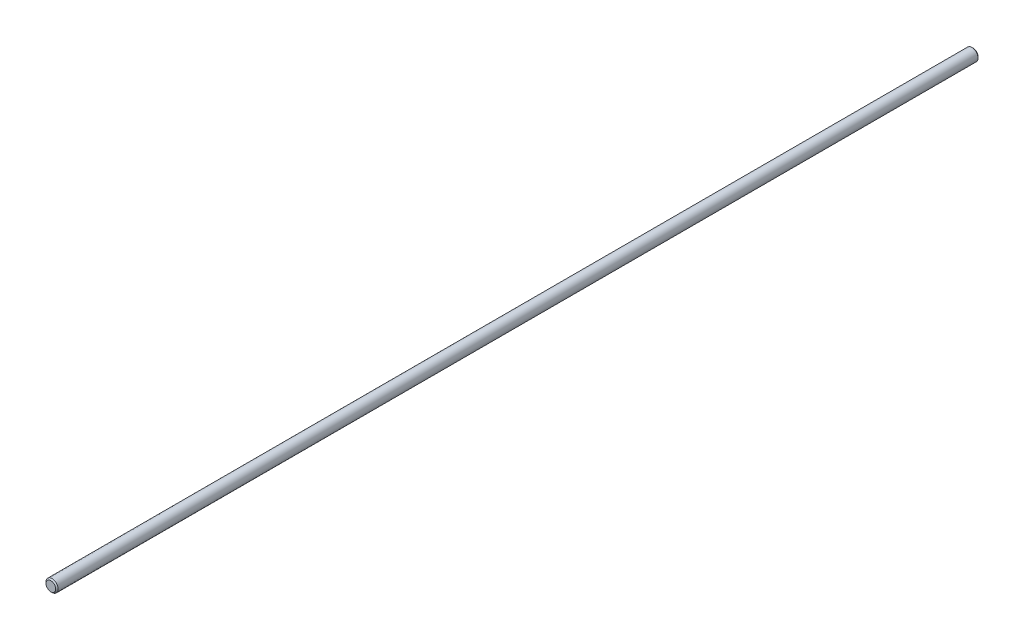
ISO-10303-21;
HEADER;
FILE_DESCRIPTION(('STEP AP214'),'2;1');
FILE_NAME('part.step','',(''),(''),'','','');
FILE_SCHEMA(('AUTOMOTIVE_DESIGN { 1 0 10303 214 1 1 1 1 }'));
ENDSEC;
DATA;
#1=APPLICATION_CONTEXT('core data for automotive mechanical design processes');
#2=APPLICATION_PROTOCOL_DEFINITION('international standard','automotive_design',2000,#1);
#3=PRODUCT_CONTEXT('',#1,'mechanical');
#4=PRODUCT('Part','Part','',(#3));
#5=PRODUCT_RELATED_PRODUCT_CATEGORY('part','',(#4));
#6=PRODUCT_DEFINITION_FORMATION('','',#4);
#7=PRODUCT_DEFINITION_CONTEXT('part definition',#1,'design');
#8=PRODUCT_DEFINITION('design','',#6,#7);
#9=PRODUCT_DEFINITION_SHAPE('','',#8);
#10=(LENGTH_UNIT() NAMED_UNIT(*) SI_UNIT(.MILLI.,.METRE.));
#11=(NAMED_UNIT(*) PLANE_ANGLE_UNIT() SI_UNIT($,.RADIAN.));
#12=(NAMED_UNIT(*) SI_UNIT($,.STERADIAN.) SOLID_ANGLE_UNIT());
#13=UNCERTAINTY_MEASURE_WITH_UNIT(LENGTH_MEASURE(1.E-05),#10,'distance_accuracy_value','');
#14=(GEOMETRIC_REPRESENTATION_CONTEXT(3) GLOBAL_UNCERTAINTY_ASSIGNED_CONTEXT((#13)) GLOBAL_UNIT_ASSIGNED_CONTEXT((#10,
#11,#12)) REPRESENTATION_CONTEXT('',''));
#15=CARTESIAN_POINT('',(0.,0.,0.));
#16=DIRECTION('',(0.,0.,1.));
#17=DIRECTION('',(1.,0.,0.));
#18=AXIS2_PLACEMENT_3D('',#15,#16,#17);
#19=CARTESIAN_POINT('',(0.,0.,241.3));
#20=DIRECTION('',(0.,0.,-1.));
#21=DIRECTION('',(-1.,0.,0.));
#22=AXIS2_PLACEMENT_3D('',#19,#20,#21);
#23=CYLINDRICAL_SURFACE('',#22,3.175);
#24=CARTESIAN_POINT('',(0.,0.,240.665));
#25=DIRECTION('',(0.,0.,1.));
#26=DIRECTION('',(1.,0.,0.));
#27=AXIS2_PLACEMENT_3D('',#24,#25,#26);
#28=CIRCLE('',#27,3.175);
#29=CARTESIAN_POINT('',(3.175,0.,240.665));
#30=VERTEX_POINT('',#29);
#31=EDGE_CURVE('E43',#30,#30,#28,.F.);
#32=ORIENTED_EDGE('',*,*,#31,.T.);
#33=EDGE_LOOP('',(#32));
#34=FACE_BOUND('',#33,.T.);
#35=CARTESIAN_POINT('',(0.,0.,-240.665));
#36=DIRECTION('',(0.,0.,1.));
#37=DIRECTION('',(1.,0.,0.));
#38=AXIS2_PLACEMENT_3D('',#35,#36,#37);
#39=CIRCLE('',#38,3.175);
#40=CARTESIAN_POINT('',(3.175,0.,-240.665));
#41=VERTEX_POINT('',#40);
#42=EDGE_CURVE('E47',#41,#41,#39,.T.);
#43=ORIENTED_EDGE('',*,*,#42,.T.);
#44=EDGE_LOOP('',(#43));
#45=FACE_BOUND('',#44,.T.);
#46=ADVANCED_FACE('F36',(#34,#45),#23,.T.);
#47=CARTESIAN_POINT('',(0.,0.,241.3));
#48=DIRECTION('',(0.,0.,1.));
#49=DIRECTION('',(1.,0.,0.));
#50=AXIS2_PLACEMENT_3D('',#47,#48,#49);
#51=PLANE('',#50);
#52=CARTESIAN_POINT('',(0.,0.,241.3));
#53=DIRECTION('',(0.,0.,1.));
#54=DIRECTION('',(1.,0.,0.));
#55=AXIS2_PLACEMENT_3D('',#52,#53,#54);
#56=CIRCLE('',#55,2.54000000000021);
#57=CARTESIAN_POINT('',(2.54000000000021,0.,241.3));
#58=VERTEX_POINT('',#57);
#59=EDGE_CURVE('E51',#58,#58,#56,.T.);
#60=ORIENTED_EDGE('',*,*,#59,.T.);
#61=EDGE_LOOP('',(#60));
#62=FACE_BOUND('',#61,.T.);
#63=ADVANCED_FACE('F57',(#62),#51,.T.);
#64=CARTESIAN_POINT('',(0.,0.,-241.3));
#65=DIRECTION('',(0.,0.,1.));
#66=DIRECTION('',(1.,0.,0.));
#67=AXIS2_PLACEMENT_3D('',#64,#65,#66);
#68=PLANE('',#67);
#69=CARTESIAN_POINT('',(0.,0.,-241.3));
#70=DIRECTION('',(0.,0.,1.));
#71=DIRECTION('',(1.,0.,0.));
#72=AXIS2_PLACEMENT_3D('',#69,#70,#71);
#73=CIRCLE('',#72,2.5399999999996);
#74=CARTESIAN_POINT('',(2.5399999999996,0.,-241.3));
#75=VERTEX_POINT('',#74);
#76=EDGE_CURVE('E10',#75,#75,#73,.F.);
#77=ORIENTED_EDGE('',*,*,#76,.T.);
#78=EDGE_LOOP('',(#77));
#79=FACE_BOUND('',#78,.T.);
#80=ADVANCED_FACE('F61',(#79),#68,.F.);
#81=CARTESIAN_POINT('',(0.,0.,241.3));
#82=DIRECTION('',(0.,0.,-1.));
#83=DIRECTION('',(-1.,0.,0.));
#84=AXIS2_PLACEMENT_3D('',#81,#82,#83);
#85=CONICAL_SURFACE('',#84,2.54000000000021,0.78539816339744);
#86=ORIENTED_EDGE('',*,*,#31,.F.);
#87=EDGE_LOOP('',(#86));
#88=FACE_BOUND('',#87,.T.);
#89=ORIENTED_EDGE('',*,*,#59,.F.);
#90=EDGE_LOOP('',(#89));
#91=FACE_BOUND('',#90,.T.);
#92=ADVANCED_FACE('F59',(#88,#91),#85,.T.);
#93=CARTESIAN_POINT('',(0.,0.,-240.665));
#94=DIRECTION('',(0.,0.,1.));
#95=DIRECTION('',(1.,0.,0.));
#96=AXIS2_PLACEMENT_3D('',#93,#94,#95);
#97=CONICAL_SURFACE('',#96,3.175,0.785398163397505);
#98=ORIENTED_EDGE('',*,*,#76,.F.);
#99=EDGE_LOOP('',(#98));
#100=FACE_BOUND('',#99,.T.);
#101=ORIENTED_EDGE('',*,*,#42,.F.);
#102=EDGE_LOOP('',(#101));
#103=FACE_BOUND('',#102,.T.);
#104=ADVANCED_FACE('F38',(#100,#103),#97,.T.);
#105=CLOSED_SHELL('',(#46,#63,#80,#92,#104));
#106=MANIFOLD_SOLID_BREP('B2',#105);
#107=ADVANCED_BREP_SHAPE_REPRESENTATION('',(#18,#106),#14);
#108=SHAPE_DEFINITION_REPRESENTATION(#9,#107);
ENDSEC;
END-ISO-10303-21;
